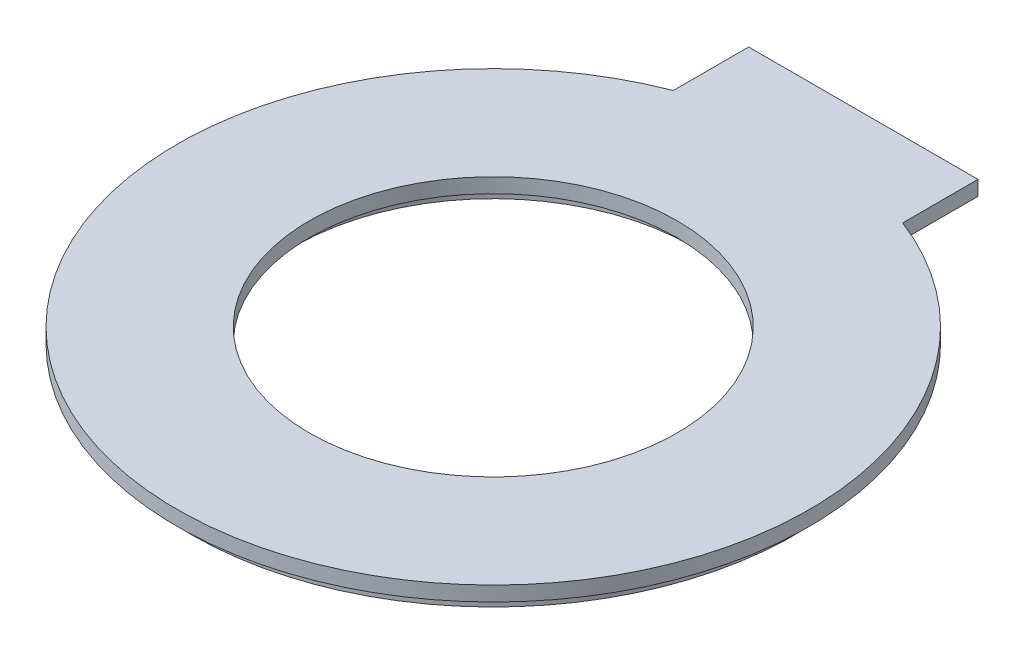
ISO-10303-21;
HEADER;
FILE_DESCRIPTION(('STEP AP214'),'2;1');
FILE_NAME('part.step','',(''),(''),'','','');
FILE_SCHEMA(('AUTOMOTIVE_DESIGN { 1 0 10303 214 1 1 1 1 }'));
ENDSEC;
DATA;
#1=APPLICATION_CONTEXT('core data for automotive mechanical design processes');
#2=APPLICATION_PROTOCOL_DEFINITION('international standard','automotive_design',2000,#1);
#3=PRODUCT_CONTEXT('',#1,'mechanical');
#4=PRODUCT('Part','Part','',(#3));
#5=PRODUCT_RELATED_PRODUCT_CATEGORY('part','',(#4));
#6=PRODUCT_DEFINITION_FORMATION('','',#4);
#7=PRODUCT_DEFINITION_CONTEXT('part definition',#1,'design');
#8=PRODUCT_DEFINITION('design','',#6,#7);
#9=PRODUCT_DEFINITION_SHAPE('','',#8);
#10=(LENGTH_UNIT() NAMED_UNIT(*) SI_UNIT(.MILLI.,.METRE.));
#11=(NAMED_UNIT(*) PLANE_ANGLE_UNIT() SI_UNIT($,.RADIAN.));
#12=(NAMED_UNIT(*) SI_UNIT($,.STERADIAN.) SOLID_ANGLE_UNIT());
#13=UNCERTAINTY_MEASURE_WITH_UNIT(LENGTH_MEASURE(1.E-05),#10,'distance_accuracy_value','');
#14=(GEOMETRIC_REPRESENTATION_CONTEXT(3) GLOBAL_UNCERTAINTY_ASSIGNED_CONTEXT((#13)) GLOBAL_UNIT_ASSIGNED_CONTEXT((#10,
#11,#12)) REPRESENTATION_CONTEXT('',''));
#15=CARTESIAN_POINT('',(0.,0.,0.));
#16=DIRECTION('',(0.,0.,1.));
#17=DIRECTION('',(1.,0.,0.));
#18=AXIS2_PLACEMENT_3D('',#15,#16,#17);
#19=CARTESIAN_POINT('',(0.,0.,0.));
#20=DIRECTION('',(0.,1.,0.));
#21=DIRECTION('',(0.,0.,1.));
#22=AXIS2_PLACEMENT_3D('',#19,#20,#21);
#23=PLANE('',#22);
#24=CARTESIAN_POINT('',(0.,0.,0.));
#25=DIRECTION('',(0.,1.,0.));
#26=DIRECTION('',(0.,0.,1.));
#27=AXIS2_PLACEMENT_3D('',#24,#25,#26);
#28=CIRCLE('',#27,12.5);
#29=CARTESIAN_POINT('',(0.,0.,12.5));
#30=VERTEX_POINT('',#29);
#31=EDGE_CURVE('E120',#30,#30,#28,.T.);
#32=ORIENTED_EDGE('',*,*,#31,.T.);
#33=EDGE_LOOP('',(#32));
#34=FACE_BOUND('',#33,.T.);
#35=CARTESIAN_POINT('',(0.,0.,0.));
#36=DIRECTION('',(0.,-1.,0.));
#37=DIRECTION('',(0.,0.,-1.));
#38=AXIS2_PLACEMENT_3D('',#35,#36,#37);
#39=CIRCLE('',#38,13.5);
#40=CARTESIAN_POINT('',(0.,0.,-13.5));
#41=VERTEX_POINT('',#40);
#42=EDGE_CURVE('E210',#41,#41,#39,.T.);
#43=ORIENTED_EDGE('',*,*,#42,.T.);
#44=EDGE_LOOP('',(#43));
#45=FACE_BOUND('',#44,.T.);
#46=ADVANCED_FACE('F33',(#34,#45),#23,.F.);
#47=CARTESIAN_POINT('',(0.,1.,0.));
#48=DIRECTION('',(0.,1.,0.));
#49=DIRECTION('',(0.,0.,1.));
#50=AXIS2_PLACEMENT_3D('',#47,#48,#49);
#51=PLANE('',#50);
#52=CARTESIAN_POINT('',(0.,1.,0.));
#53=DIRECTION('',(0.,1.,0.));
#54=DIRECTION('',(0.,0.,1.));
#55=AXIS2_PLACEMENT_3D('',#52,#53,#54);
#56=CIRCLE('',#55,21.5);
#57=CARTESIAN_POINT('',(-7.795,1.,-20.0371648443586));
#58=VERTEX_POINT('',#57);
#59=CARTESIAN_POINT('',(7.795,1.,-20.0371648443586));
#60=VERTEX_POINT('',#59);
#61=EDGE_CURVE('E132',#58,#60,#56,.T.);
#62=ORIENTED_EDGE('',*,*,#61,.T.);
#63=DIRECTION('',(0.,0.,-1.));
#64=VECTOR('',#63,1.);
#65=CARTESIAN_POINT('',(7.795,1.,-20.0371648443586));
#66=LINE('',#65,#64);
#67=CARTESIAN_POINT('',(7.795,1.,-25.1571648443586));
#68=VERTEX_POINT('',#67);
#69=EDGE_CURVE('E135',#60,#68,#66,.T.);
#70=ORIENTED_EDGE('',*,*,#69,.T.);
#71=DIRECTION('',(-1.,0.,0.));
#72=VECTOR('',#71,1.);
#73=CARTESIAN_POINT('',(-7.795,1.,-25.1571648443586));
#74=LINE('',#73,#72);
#75=CARTESIAN_POINT('',(-7.795,1.,-25.1571648443586));
#76=VERTEX_POINT('',#75);
#77=EDGE_CURVE('E138',#68,#76,#74,.T.);
#78=ORIENTED_EDGE('',*,*,#77,.T.);
#79=DIRECTION('',(0.,0.,1.));
#80=VECTOR('',#79,1.);
#81=CARTESIAN_POINT('',(-7.795,1.,-20.0371648443586));
#82=LINE('',#81,#80);
#83=EDGE_CURVE('E140',#76,#58,#82,.T.);
#84=ORIENTED_EDGE('',*,*,#83,.T.);
#85=EDGE_LOOP('',(#62,#70,#78,#84));
#86=FACE_BOUND('',#85,.T.);
#87=CARTESIAN_POINT('',(0.,1.,0.));
#88=DIRECTION('',(0.,1.,0.));
#89=DIRECTION('',(0.,0.,1.));
#90=AXIS2_PLACEMENT_3D('',#87,#88,#89);
#91=CIRCLE('',#90,12.5);
#92=CARTESIAN_POINT('',(0.,1.,12.5));
#93=VERTEX_POINT('',#92);
#94=EDGE_CURVE('E123',#93,#93,#91,.T.);
#95=ORIENTED_EDGE('',*,*,#94,.F.);
#96=EDGE_LOOP('',(#95));
#97=FACE_BOUND('',#96,.T.);
#98=ADVANCED_FACE('F174',(#86,#97),#51,.T.);
#99=DIRECTION('',(0.,0.,-1.));
#100=VECTOR('',#99,1.);
#101=CARTESIAN_POINT('',(-6.795,0.,-24.1571648443586));
#102=LINE('',#101,#100);
#103=CARTESIAN_POINT('',(-6.795,0.,-19.3410954963777));
#104=VERTEX_POINT('',#103);
#105=CARTESIAN_POINT('',(-6.795,0.,-24.1571648443586));
#106=VERTEX_POINT('',#105);
#107=EDGE_CURVE('E119',#104,#106,#102,.T.);
#108=ORIENTED_EDGE('',*,*,#107,.F.);
#109=CARTESIAN_POINT('',(0.,0.,0.));
#110=DIRECTION('',(0.,-1.,0.));
#111=DIRECTION('',(0.,0.,-1.));
#112=AXIS2_PLACEMENT_3D('',#109,#110,#111);
#113=CIRCLE('',#112,20.5);
#114=CARTESIAN_POINT('',(6.795,0.,-19.3410954963777));
#115=VERTEX_POINT('',#114);
#116=EDGE_CURVE('E116',#115,#104,#113,.T.);
#117=ORIENTED_EDGE('',*,*,#116,.F.);
#118=DIRECTION('',(0.,0.,1.));
#119=VECTOR('',#118,1.);
#120=CARTESIAN_POINT('',(6.795,0.,-24.1571648443586));
#121=LINE('',#120,#119);
#122=CARTESIAN_POINT('',(6.795,0.,-24.1571648443586));
#123=VERTEX_POINT('',#122);
#124=EDGE_CURVE('E53',#123,#115,#121,.T.);
#125=ORIENTED_EDGE('',*,*,#124,.F.);
#126=DIRECTION('',(1.,0.,0.));
#127=VECTOR('',#126,1.);
#128=CARTESIAN_POINT('',(-6.795,0.,-24.1571648443586));
#129=LINE('',#128,#127);
#130=EDGE_CURVE('E48',#106,#123,#129,.T.);
#131=ORIENTED_EDGE('',*,*,#130,.F.);
#132=EDGE_LOOP('',(#108,#117,#125,#131));
#133=FACE_BOUND('',#132,.T.);
#134=CARTESIAN_POINT('',(0.,0.,0.));
#135=DIRECTION('',(0.,1.,0.));
#136=DIRECTION('',(0.,0.,1.));
#137=AXIS2_PLACEMENT_3D('',#134,#135,#136);
#138=CIRCLE('',#137,21.5);
#139=CARTESIAN_POINT('',(-7.795,0.,-20.0371648443586));
#140=VERTEX_POINT('',#139);
#141=CARTESIAN_POINT('',(7.795,0.,-20.0371648443586));
#142=VERTEX_POINT('',#141);
#143=EDGE_CURVE('E130',#140,#142,#138,.T.);
#144=ORIENTED_EDGE('',*,*,#143,.F.);
#145=DIRECTION('',(0.,0.,1.));
#146=VECTOR('',#145,1.);
#147=CARTESIAN_POINT('',(-7.795,0.,-20.0371648443586));
#148=LINE('',#147,#146);
#149=CARTESIAN_POINT('',(-7.795,0.,-25.1571648443586));
#150=VERTEX_POINT('',#149);
#151=EDGE_CURVE('E136',#150,#140,#148,.T.);
#152=ORIENTED_EDGE('',*,*,#151,.F.);
#153=DIRECTION('',(-1.,0.,0.));
#154=VECTOR('',#153,1.);
#155=CARTESIAN_POINT('',(-7.795,0.,-25.1571648443586));
#156=LINE('',#155,#154);
#157=CARTESIAN_POINT('',(7.795,0.,-25.1571648443586));
#158=VERTEX_POINT('',#157);
#159=EDGE_CURVE('E147',#158,#150,#156,.T.);
#160=ORIENTED_EDGE('',*,*,#159,.F.);
#161=DIRECTION('',(0.,0.,-1.));
#162=VECTOR('',#161,1.);
#163=CARTESIAN_POINT('',(7.795,0.,-20.0371648443586));
#164=LINE('',#163,#162);
#165=EDGE_CURVE('E145',#142,#158,#164,.T.);
#166=ORIENTED_EDGE('',*,*,#165,.F.);
#167=EDGE_LOOP('',(#144,#152,#160,#166));
#168=FACE_BOUND('',#167,.T.);
#169=ADVANCED_FACE('F165',(#133,#168),#23,.F.);
#170=CARTESIAN_POINT('',(0.,1.,0.));
#171=DIRECTION('',(0.,-1.,0.));
#172=DIRECTION('',(0.,0.,-1.));
#173=AXIS2_PLACEMENT_3D('',#170,#171,#172);
#174=CYLINDRICAL_SURFACE('',#173,21.5);
#175=ORIENTED_EDGE('',*,*,#143,.T.);
#176=DIRECTION('',(0.,-1.,0.));
#177=VECTOR('',#176,1.);
#178=CARTESIAN_POINT('',(7.795,1.,-20.0371648443586));
#179=LINE('',#178,#177);
#180=EDGE_CURVE('E11',#60,#142,#179,.T.);
#181=ORIENTED_EDGE('',*,*,#180,.F.);
#182=ORIENTED_EDGE('',*,*,#61,.F.);
#183=DIRECTION('',(0.,-1.,0.));
#184=VECTOR('',#183,1.);
#185=CARTESIAN_POINT('',(-7.795,1.,-20.0371648443586));
#186=LINE('',#185,#184);
#187=EDGE_CURVE('E142',#58,#140,#186,.T.);
#188=ORIENTED_EDGE('',*,*,#187,.T.);
#189=EDGE_LOOP('',(#175,#181,#182,#188));
#190=FACE_BOUND('',#189,.T.);
#191=ADVANCED_FACE('F35',(#190),#174,.T.);
#192=CARTESIAN_POINT('',(7.795,1.,-20.0371648443586));
#193=DIRECTION('',(-1.,0.,0.));
#194=DIRECTION('',(0.,0.,1.));
#195=AXIS2_PLACEMENT_3D('',#192,#193,#194);
#196=PLANE('',#195);
#197=ORIENTED_EDGE('',*,*,#165,.T.);
#198=DIRECTION('',(0.,-1.,0.));
#199=VECTOR('',#198,1.);
#200=CARTESIAN_POINT('',(7.795,1.,-25.1571648443586));
#201=LINE('',#200,#199);
#202=EDGE_CURVE('E41',#68,#158,#201,.T.);
#203=ORIENTED_EDGE('',*,*,#202,.F.);
#204=ORIENTED_EDGE('',*,*,#69,.F.);
#205=ORIENTED_EDGE('',*,*,#180,.T.);
#206=EDGE_LOOP('',(#197,#203,#204,#205));
#207=FACE_BOUND('',#206,.T.);
#208=ADVANCED_FACE('F176',(#207),#196,.F.);
#209=CARTESIAN_POINT('',(-7.795,1.,-25.1571648443586));
#210=DIRECTION('',(0.,0.,1.));
#211=DIRECTION('',(1.,0.,0.));
#212=AXIS2_PLACEMENT_3D('',#209,#210,#211);
#213=PLANE('',#212);
#214=ORIENTED_EDGE('',*,*,#159,.T.);
#215=DIRECTION('',(0.,-1.,0.));
#216=VECTOR('',#215,1.);
#217=CARTESIAN_POINT('',(-7.795,1.,-25.1571648443586));
#218=LINE('',#217,#216);
#219=EDGE_CURVE('E152',#76,#150,#218,.T.);
#220=ORIENTED_EDGE('',*,*,#219,.F.);
#221=ORIENTED_EDGE('',*,*,#77,.F.);
#222=ORIENTED_EDGE('',*,*,#202,.T.);
#223=EDGE_LOOP('',(#214,#220,#221,#222));
#224=FACE_BOUND('',#223,.T.);
#225=ADVANCED_FACE('F159',(#224),#213,.F.);
#226=CARTESIAN_POINT('',(-7.795,1.,-20.0371648443586));
#227=DIRECTION('',(1.,0.,0.));
#228=DIRECTION('',(0.,0.,-1.));
#229=AXIS2_PLACEMENT_3D('',#226,#227,#228);
#230=PLANE('',#229);
#231=ORIENTED_EDGE('',*,*,#151,.T.);
#232=ORIENTED_EDGE('',*,*,#187,.F.);
#233=ORIENTED_EDGE('',*,*,#83,.F.);
#234=ORIENTED_EDGE('',*,*,#219,.T.);
#235=EDGE_LOOP('',(#231,#232,#233,#234));
#236=FACE_BOUND('',#235,.T.);
#237=ADVANCED_FACE('F168',(#236),#230,.F.);
#238=CARTESIAN_POINT('',(0.,1.,0.));
#239=DIRECTION('',(0.,-1.,0.));
#240=DIRECTION('',(0.,0.,-1.));
#241=AXIS2_PLACEMENT_3D('',#238,#239,#240);
#242=CYLINDRICAL_SURFACE('',#241,12.5);
#243=ORIENTED_EDGE('',*,*,#94,.T.);
#244=EDGE_LOOP('',(#243));
#245=FACE_BOUND('',#244,.T.);
#246=ORIENTED_EDGE('',*,*,#31,.F.);
#247=EDGE_LOOP('',(#246));
#248=FACE_BOUND('',#247,.T.);
#249=ADVANCED_FACE('F219',(#245,#248),#242,.F.);
#250=CARTESIAN_POINT('',(0.,-1.,0.));
#251=DIRECTION('',(0.,-1.,0.));
#252=DIRECTION('',(0.,0.,-1.));
#253=AXIS2_PLACEMENT_3D('',#250,#251,#252);
#254=PLANE('',#253);
#255=DIRECTION('',(0.,0.,-1.));
#256=VECTOR('',#255,1.);
#257=CARTESIAN_POINT('',(-6.795,-1.,-24.1571648443586));
#258=LINE('',#257,#256);
#259=CARTESIAN_POINT('',(-6.795,-1.,-19.3410954963777));
#260=VERTEX_POINT('',#259);
#261=CARTESIAN_POINT('',(-6.795,-1.,-24.1571648443586));
#262=VERTEX_POINT('',#261);
#263=EDGE_CURVE('E106',#260,#262,#258,.T.);
#264=ORIENTED_EDGE('',*,*,#263,.T.);
#265=DIRECTION('',(1.,0.,0.));
#266=VECTOR('',#265,1.);
#267=CARTESIAN_POINT('',(-6.795,-1.,-24.1571648443586));
#268=LINE('',#267,#266);
#269=CARTESIAN_POINT('',(6.795,-1.,-24.1571648443586));
#270=VERTEX_POINT('',#269);
#271=EDGE_CURVE('E95',#262,#270,#268,.T.);
#272=ORIENTED_EDGE('',*,*,#271,.T.);
#273=DIRECTION('',(0.,0.,1.));
#274=VECTOR('',#273,1.);
#275=CARTESIAN_POINT('',(6.795,-1.,-24.1571648443586));
#276=LINE('',#275,#274);
#277=CARTESIAN_POINT('',(6.795,-1.,-19.3410954963777));
#278=VERTEX_POINT('',#277);
#279=EDGE_CURVE('E105',#270,#278,#276,.T.);
#280=ORIENTED_EDGE('',*,*,#279,.T.);
#281=CARTESIAN_POINT('',(0.,-1.,0.));
#282=DIRECTION('',(0.,-1.,0.));
#283=DIRECTION('',(0.,0.,-1.));
#284=AXIS2_PLACEMENT_3D('',#281,#282,#283);
#285=CIRCLE('',#284,20.5);
#286=EDGE_CURVE('E112',#278,#260,#285,.T.);
#287=ORIENTED_EDGE('',*,*,#286,.T.);
#288=EDGE_LOOP('',(#264,#272,#280,#287));
#289=FACE_BOUND('',#288,.T.);
#290=CARTESIAN_POINT('',(0.,-1.,0.));
#291=DIRECTION('',(0.,-1.,0.));
#292=DIRECTION('',(0.,0.,-1.));
#293=AXIS2_PLACEMENT_3D('',#290,#291,#292);
#294=CIRCLE('',#293,13.5);
#295=CARTESIAN_POINT('',(0.,-1.,-13.5));
#296=VERTEX_POINT('',#295);
#297=EDGE_CURVE('E196',#296,#296,#294,.T.);
#298=ORIENTED_EDGE('',*,*,#297,.F.);
#299=EDGE_LOOP('',(#298));
#300=FACE_BOUND('',#299,.T.);
#301=ADVANCED_FACE('F109',(#289,#300),#254,.T.);
#302=CARTESIAN_POINT('',(-6.795,-1.,-24.1571648443586));
#303=DIRECTION('',(1.,0.,0.));
#304=DIRECTION('',(0.,0.,-1.));
#305=AXIS2_PLACEMENT_3D('',#302,#303,#304);
#306=PLANE('',#305);
#307=ORIENTED_EDGE('',*,*,#107,.T.);
#308=DIRECTION('',(0.,1.,0.));
#309=VECTOR('',#308,1.);
#310=CARTESIAN_POINT('',(-6.795,-1.,-24.1571648443586));
#311=LINE('',#310,#309);
#312=EDGE_CURVE('E99',#262,#106,#311,.T.);
#313=ORIENTED_EDGE('',*,*,#312,.F.);
#314=ORIENTED_EDGE('',*,*,#263,.F.);
#315=DIRECTION('',(0.,1.,0.));
#316=VECTOR('',#315,1.);
#317=CARTESIAN_POINT('',(-6.795,-1.,-19.3410954963777));
#318=LINE('',#317,#316);
#319=EDGE_CURVE('E201',#260,#104,#318,.T.);
#320=ORIENTED_EDGE('',*,*,#319,.T.);
#321=EDGE_LOOP('',(#307,#313,#314,#320));
#322=FACE_BOUND('',#321,.T.);
#323=ADVANCED_FACE('F118',(#322),#306,.F.);
#324=CARTESIAN_POINT('',(-6.795,-1.,-24.1571648443586));
#325=DIRECTION('',(0.,0.,1.));
#326=DIRECTION('',(1.,0.,0.));
#327=AXIS2_PLACEMENT_3D('',#324,#325,#326);
#328=PLANE('',#327);
#329=ORIENTED_EDGE('',*,*,#130,.T.);
#330=DIRECTION('',(0.,1.,0.));
#331=VECTOR('',#330,1.);
#332=CARTESIAN_POINT('',(6.795,-1.,-24.1571648443586));
#333=LINE('',#332,#331);
#334=EDGE_CURVE('E102',#270,#123,#333,.T.);
#335=ORIENTED_EDGE('',*,*,#334,.F.);
#336=ORIENTED_EDGE('',*,*,#271,.F.);
#337=ORIENTED_EDGE('',*,*,#312,.T.);
#338=EDGE_LOOP('',(#329,#335,#336,#337));
#339=FACE_BOUND('',#338,.T.);
#340=ADVANCED_FACE('F97',(#339),#328,.F.);
#341=CARTESIAN_POINT('',(6.795,-1.,-24.1571648443586));
#342=DIRECTION('',(-1.,0.,0.));
#343=DIRECTION('',(0.,0.,1.));
#344=AXIS2_PLACEMENT_3D('',#341,#342,#343);
#345=PLANE('',#344);
#346=ORIENTED_EDGE('',*,*,#124,.T.);
#347=DIRECTION('',(0.,1.,0.));
#348=VECTOR('',#347,1.);
#349=CARTESIAN_POINT('',(6.795,-1.,-19.3410954963777));
#350=LINE('',#349,#348);
#351=EDGE_CURVE('E125',#278,#115,#350,.T.);
#352=ORIENTED_EDGE('',*,*,#351,.F.);
#353=ORIENTED_EDGE('',*,*,#279,.F.);
#354=ORIENTED_EDGE('',*,*,#334,.T.);
#355=EDGE_LOOP('',(#346,#352,#353,#354));
#356=FACE_BOUND('',#355,.T.);
#357=ADVANCED_FACE('F232',(#356),#345,.F.);
#358=CARTESIAN_POINT('',(0.,-1.,0.));
#359=DIRECTION('',(0.,1.,0.));
#360=DIRECTION('',(0.,0.,1.));
#361=AXIS2_PLACEMENT_3D('',#358,#359,#360);
#362=CYLINDRICAL_SURFACE('',#361,20.5);
#363=ORIENTED_EDGE('',*,*,#116,.T.);
#364=ORIENTED_EDGE('',*,*,#319,.F.);
#365=ORIENTED_EDGE('',*,*,#286,.F.);
#366=ORIENTED_EDGE('',*,*,#351,.T.);
#367=EDGE_LOOP('',(#363,#364,#365,#366));
#368=FACE_BOUND('',#367,.T.);
#369=ADVANCED_FACE('F200',(#368),#362,.T.);
#370=CARTESIAN_POINT('',(0.,-1.,0.));
#371=DIRECTION('',(0.,1.,0.));
#372=DIRECTION('',(0.,0.,1.));
#373=AXIS2_PLACEMENT_3D('',#370,#371,#372);
#374=CYLINDRICAL_SURFACE('',#373,13.5);
#375=ORIENTED_EDGE('',*,*,#297,.T.);
#376=EDGE_LOOP('',(#375));
#377=FACE_BOUND('',#376,.T.);
#378=ORIENTED_EDGE('',*,*,#42,.F.);
#379=EDGE_LOOP('',(#378));
#380=FACE_BOUND('',#379,.T.);
#381=ADVANCED_FACE('F216',(#377,#380),#374,.F.);
#382=CLOSED_SHELL('',(#46,#98,#169,#191,#208,#225,#237,#249,#301,#323,#340,#357,#369,#381));
#383=MANIFOLD_SOLID_BREP('B2',#382);
#384=ADVANCED_BREP_SHAPE_REPRESENTATION('',(#18,#383),#14);
#385=SHAPE_DEFINITION_REPRESENTATION(#9,#384);
ENDSEC;
END-ISO-10303-21;
